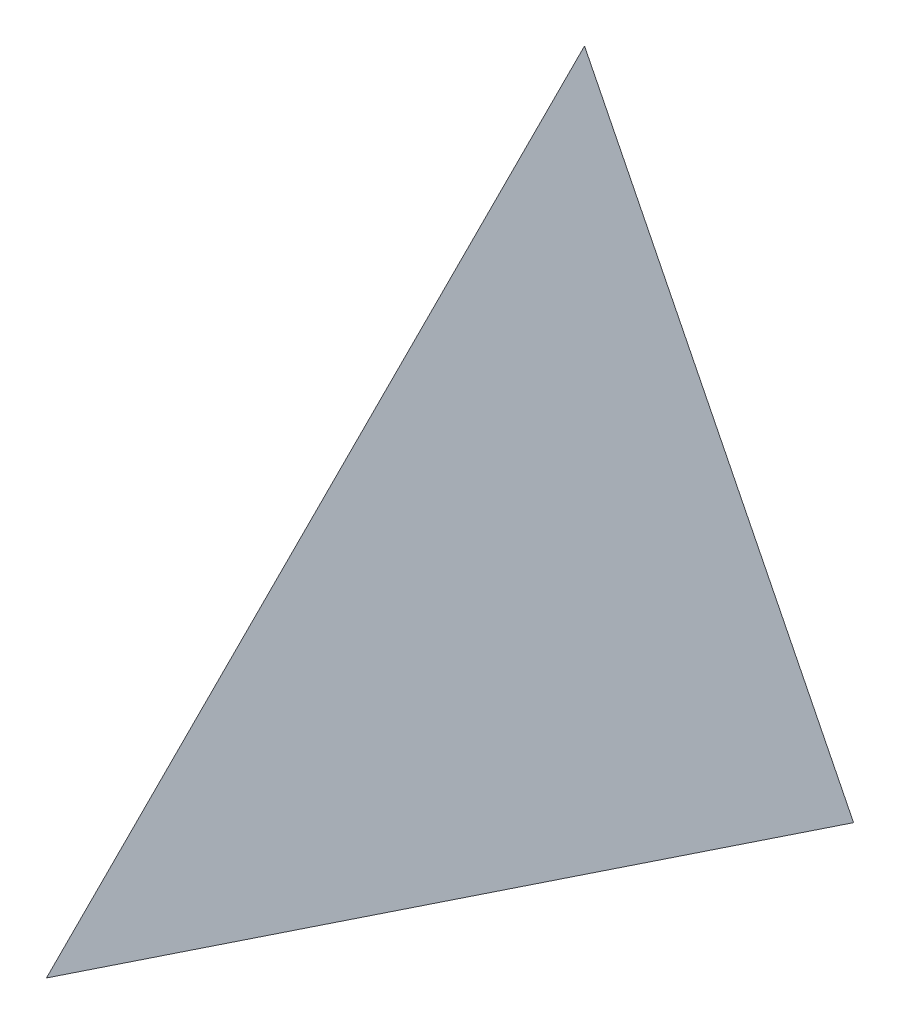
ISO-10303-21;
HEADER;
FILE_DESCRIPTION(('STEP AP214'),'2;1');
FILE_NAME('part.step','',(''),(''),'','','');
FILE_SCHEMA(('AUTOMOTIVE_DESIGN { 1 0 10303 214 1 1 1 1 }'));
ENDSEC;
DATA;
#1=APPLICATION_CONTEXT('core data for automotive mechanical design processes');
#2=APPLICATION_PROTOCOL_DEFINITION('international standard','automotive_design',2000,#1);
#3=PRODUCT_CONTEXT('',#1,'mechanical');
#4=PRODUCT('Part','Part','',(#3));
#5=PRODUCT_RELATED_PRODUCT_CATEGORY('part','',(#4));
#6=PRODUCT_DEFINITION_FORMATION('','',#4);
#7=PRODUCT_DEFINITION_CONTEXT('part definition',#1,'design');
#8=PRODUCT_DEFINITION('design','',#6,#7);
#9=PRODUCT_DEFINITION_SHAPE('','',#8);
#10=(LENGTH_UNIT() NAMED_UNIT(*) SI_UNIT(.MILLI.,.METRE.));
#11=(NAMED_UNIT(*) PLANE_ANGLE_UNIT() SI_UNIT($,.RADIAN.));
#12=(NAMED_UNIT(*) SI_UNIT($,.STERADIAN.) SOLID_ANGLE_UNIT());
#13=UNCERTAINTY_MEASURE_WITH_UNIT(LENGTH_MEASURE(1.E-05),#10,'distance_accuracy_value','');
#14=(GEOMETRIC_REPRESENTATION_CONTEXT(3) GLOBAL_UNCERTAINTY_ASSIGNED_CONTEXT((#13)) GLOBAL_UNIT_ASSIGNED_CONTEXT((#10,
#11,#12)) REPRESENTATION_CONTEXT('',''));
#15=CARTESIAN_POINT('',(0.,0.,0.));
#16=DIRECTION('',(0.,0.,1.));
#17=DIRECTION('',(1.,0.,0.));
#18=AXIS2_PLACEMENT_3D('',#15,#16,#17);
#19=CARTESIAN_POINT('',(-0.666666666666668,0.333333333333334,0.333333333333334));
#20=DIRECTION('',(0.816496580927726,-0.408248290463863,-0.408248290463863));
#21=DIRECTION('',(0.447213595499958,0.894427190999916,0.));
#22=AXIS2_PLACEMENT_3D('',#19,#20,#21);
#23=PLANE('',#22);
#24=DIRECTION('',(0.,0.707106781186548,-0.707106781186548));
#25=VECTOR('',#24,1.);
#26=CARTESIAN_POINT('',(0.,0.,2.));
#27=LINE('',#26,#25);
#28=CARTESIAN_POINT('',(0.,0.,2.));
#29=VERTEX_POINT('',#28);
#30=CARTESIAN_POINT('',(0.,4.,-2.));
#31=VERTEX_POINT('',#30);
#32=EDGE_CURVE('E60',#29,#31,#27,.T.);
#33=ORIENTED_EDGE('',*,*,#32,.T.);
#34=DIRECTION('',(-0.447213595499958,-0.894427190999916,0.));
#35=VECTOR('',#34,1.);
#36=CARTESIAN_POINT('',(0.,4.,-2.));
#37=LINE('',#36,#35);
#38=CARTESIAN_POINT('',(-2.,0.,-2.));
#39=VERTEX_POINT('',#38);
#40=EDGE_CURVE('E43',#31,#39,#37,.T.);
#41=ORIENTED_EDGE('',*,*,#40,.T.);
#42=DIRECTION('',(0.447213595499958,0.,0.894427190999916));
#43=VECTOR('',#42,1.);
#44=CARTESIAN_POINT('',(-2.,0.,-2.));
#45=LINE('',#44,#43);
#46=EDGE_CURVE('E12',#39,#29,#45,.T.);
#47=ORIENTED_EDGE('',*,*,#46,.T.);
#48=EDGE_LOOP('',(#33,#41,#47));
#49=FACE_BOUND('',#48,.T.);
#50=ADVANCED_FACE('F35',(#49),#23,.F.);
#51=CARTESIAN_POINT('',(-2.,4.,-2.));
#52=DIRECTION('',(0.,0.,1.));
#53=DIRECTION('',(1.,0.,0.));
#54=AXIS2_PLACEMENT_3D('',#51,#52,#53);
#55=PLANE('',#54);
#56=DIRECTION('',(-0.447213595499958,0.894427190999916,0.));
#57=VECTOR('',#56,1.);
#58=CARTESIAN_POINT('',(2.,0.,-2.));
#59=LINE('',#58,#57);
#60=CARTESIAN_POINT('',(2.,0.,-2.));
#61=VERTEX_POINT('',#60);
#62=EDGE_CURVE('E54',#61,#31,#59,.T.);
#63=ORIENTED_EDGE('',*,*,#62,.F.);
#64=DIRECTION('',(-1.,0.,0.));
#65=VECTOR('',#64,1.);
#66=CARTESIAN_POINT('',(-2.,0.,-2.));
#67=LINE('',#66,#65);
#68=EDGE_CURVE('E64',#61,#39,#67,.T.);
#69=ORIENTED_EDGE('',*,*,#68,.T.);
#70=ORIENTED_EDGE('',*,*,#40,.F.);
#71=EDGE_LOOP('',(#63,#69,#70));
#72=FACE_BOUND('',#71,.T.);
#73=ADVANCED_FACE('F85',(#72),#55,.F.);
#74=CARTESIAN_POINT('',(0.,0.,0.));
#75=DIRECTION('',(0.,-1.,0.));
#76=DIRECTION('',(0.,0.,-1.));
#77=AXIS2_PLACEMENT_3D('',#74,#75,#76);
#78=PLANE('',#77);
#79=ORIENTED_EDGE('',*,*,#68,.F.);
#80=DIRECTION('',(0.447213595499958,0.,-0.894427190999916));
#81=VECTOR('',#80,1.);
#82=CARTESIAN_POINT('',(0.,0.,2.));
#83=LINE('',#82,#81);
#84=EDGE_CURVE('E50',#29,#61,#83,.T.);
#85=ORIENTED_EDGE('',*,*,#84,.F.);
#86=ORIENTED_EDGE('',*,*,#46,.F.);
#87=EDGE_LOOP('',(#79,#85,#86));
#88=FACE_BOUND('',#87,.T.);
#89=ADVANCED_FACE('F37',(#88),#78,.T.);
#90=CARTESIAN_POINT('',(0.666666666666667,0.333333333333334,0.333333333333334));
#91=DIRECTION('',(0.816496580927726,0.408248290463863,0.408248290463863));
#92=DIRECTION('',(0.447213595499958,0.,-0.894427190999916));
#93=AXIS2_PLACEMENT_3D('',#90,#91,#92);
#94=PLANE('',#93);
#95=ORIENTED_EDGE('',*,*,#84,.T.);
#96=ORIENTED_EDGE('',*,*,#62,.T.);
#97=ORIENTED_EDGE('',*,*,#32,.F.);
#98=EDGE_LOOP('',(#95,#96,#97));
#99=FACE_BOUND('',#98,.T.);
#100=ADVANCED_FACE('F61',(#99),#94,.T.);
#101=CLOSED_SHELL('',(#50,#73,#89,#100));
#102=MANIFOLD_SOLID_BREP('B2',#101);
#103=ADVANCED_BREP_SHAPE_REPRESENTATION('',(#18,#102),#14);
#104=SHAPE_DEFINITION_REPRESENTATION(#9,#103);
ENDSEC;
END-ISO-10303-21;
